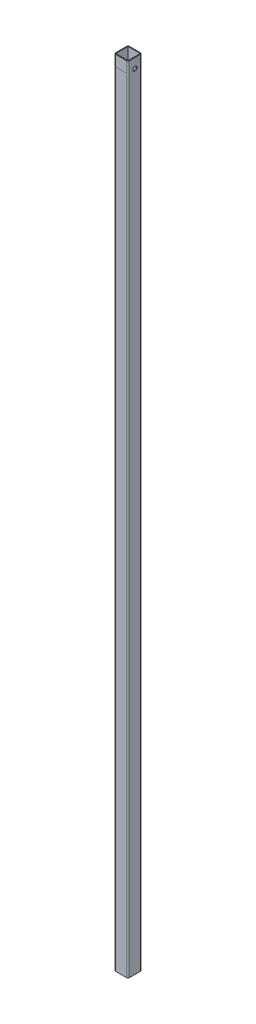
ISO-10303-21;
HEADER;
FILE_DESCRIPTION(('STEP AP214'),'2;1');
FILE_NAME('part.step','',(''),(''),'','','');
FILE_SCHEMA(('AUTOMOTIVE_DESIGN { 1 0 10303 214 1 1 1 1 }'));
ENDSEC;
DATA;
#1=APPLICATION_CONTEXT('core data for automotive mechanical design processes');
#2=APPLICATION_PROTOCOL_DEFINITION('international standard','automotive_design',2000,#1);
#3=PRODUCT_CONTEXT('',#1,'mechanical');
#4=PRODUCT('Part','Part','',(#3));
#5=PRODUCT_RELATED_PRODUCT_CATEGORY('part','',(#4));
#6=PRODUCT_DEFINITION_FORMATION('','',#4);
#7=PRODUCT_DEFINITION_CONTEXT('part definition',#1,'design');
#8=PRODUCT_DEFINITION('design','',#6,#7);
#9=PRODUCT_DEFINITION_SHAPE('','',#8);
#10=(LENGTH_UNIT() NAMED_UNIT(*) SI_UNIT(.MILLI.,.METRE.));
#11=(NAMED_UNIT(*) PLANE_ANGLE_UNIT() SI_UNIT($,.RADIAN.));
#12=(NAMED_UNIT(*) SI_UNIT($,.STERADIAN.) SOLID_ANGLE_UNIT());
#13=UNCERTAINTY_MEASURE_WITH_UNIT(LENGTH_MEASURE(1.E-05),#10,'distance_accuracy_value','');
#14=(GEOMETRIC_REPRESENTATION_CONTEXT(3) GLOBAL_UNCERTAINTY_ASSIGNED_CONTEXT((#13)) GLOBAL_UNIT_ASSIGNED_CONTEXT((#10,
#11,#12)) REPRESENTATION_CONTEXT('',''));
#15=CARTESIAN_POINT('',(0.,0.,0.));
#16=DIRECTION('',(0.,0.,1.));
#17=DIRECTION('',(1.,0.,0.));
#18=AXIS2_PLACEMENT_3D('',#15,#16,#17);
#19=CARTESIAN_POINT('',(-11.4046,1303.02,-11.4046));
#20=DIRECTION('',(0.,0.,1.));
#21=DIRECTION('',(1.,0.,0.));
#22=AXIS2_PLACEMENT_3D('',#19,#20,#21);
#23=PLANE('',#22);
#24=DIRECTION('',(-1.,0.,0.));
#25=VECTOR('',#24,1.);
#26=CARTESIAN_POINT('',(-11.4046,241.3,-11.4046));
#27=LINE('',#26,#25);
#28=CARTESIAN_POINT('',(8.8646,241.3,-11.4046));
#29=VERTEX_POINT('',#28);
#30=CARTESIAN_POINT('',(-8.8646,241.3,-11.4046));
#31=VERTEX_POINT('',#30);
#32=EDGE_CURVE('E11',#29,#31,#27,.T.);
#33=ORIENTED_EDGE('',*,*,#32,.F.);
#34=DIRECTION('',(0.,-1.,0.));
#35=VECTOR('',#34,1.);
#36=CARTESIAN_POINT('',(8.8646,1303.02,-11.4046));
#37=LINE('',#36,#35);
#38=CARTESIAN_POINT('',(8.8646,0.,-11.4046));
#39=VERTEX_POINT('',#38);
#40=EDGE_CURVE('E249',#29,#39,#37,.T.);
#41=ORIENTED_EDGE('',*,*,#40,.T.);
#42=DIRECTION('',(-1.,0.,0.));
#43=VECTOR('',#42,1.);
#44=CARTESIAN_POINT('',(-11.4046,0.,-11.4046));
#45=LINE('',#44,#43);
#46=CARTESIAN_POINT('',(-8.8646,0.,-11.4046));
#47=VERTEX_POINT('',#46);
#48=EDGE_CURVE('E204',#39,#47,#45,.T.);
#49=ORIENTED_EDGE('',*,*,#48,.T.);
#50=DIRECTION('',(0.,-1.,0.));
#51=VECTOR('',#50,1.);
#52=CARTESIAN_POINT('',(-8.8646,1303.02,-11.4046));
#53=LINE('',#52,#51);
#54=EDGE_CURVE('E246',#47,#31,#53,.F.);
#55=ORIENTED_EDGE('',*,*,#54,.T.);
#56=EDGE_LOOP('',(#33,#41,#49,#55));
#57=FACE_BOUND('',#56,.T.);
#58=ADVANCED_FACE('F37',(#57),#23,.F.);
#59=DIRECTION('',(1.,0.,0.));
#60=VECTOR('',#59,1.);
#61=CARTESIAN_POINT('',(-11.4046,259.0292,-11.4046));
#62=LINE('',#61,#60);
#63=CARTESIAN_POINT('',(-8.8646,259.0292,-11.4046));
#64=VERTEX_POINT('',#63);
#65=CARTESIAN_POINT('',(8.8646,259.0292,-11.4046));
#66=VERTEX_POINT('',#65);
#67=EDGE_CURVE('E46',#64,#66,#62,.T.);
#68=ORIENTED_EDGE('',*,*,#67,.F.);
#69=CARTESIAN_POINT('',(-8.8646,1303.02,-11.4046));
#70=VERTEX_POINT('',#69);
#71=EDGE_CURVE('E245',#64,#70,#53,.F.);
#72=ORIENTED_EDGE('',*,*,#71,.T.);
#73=DIRECTION('',(-1.,0.,0.));
#74=VECTOR('',#73,1.);
#75=CARTESIAN_POINT('',(-11.4046,1303.02,-11.4046));
#76=LINE('',#75,#74);
#77=CARTESIAN_POINT('',(8.8646,1303.02,-11.4046));
#78=VERTEX_POINT('',#77);
#79=EDGE_CURVE('E191',#78,#70,#76,.T.);
#80=ORIENTED_EDGE('',*,*,#79,.F.);
#81=EDGE_CURVE('E251',#78,#66,#37,.T.);
#82=ORIENTED_EDGE('',*,*,#81,.T.);
#83=EDGE_LOOP('',(#68,#72,#80,#82));
#84=FACE_BOUND('',#83,.T.);
#85=ADVANCED_FACE('F272',(#84),#23,.F.);
#86=CARTESIAN_POINT('',(-11.4046,1303.02,11.4046));
#87=DIRECTION('',(0.,0.,-1.));
#88=DIRECTION('',(-1.,0.,0.));
#89=AXIS2_PLACEMENT_3D('',#86,#87,#88);
#90=PLANE('',#89);
#91=DIRECTION('',(1.,0.,0.));
#92=VECTOR('',#91,1.);
#93=CARTESIAN_POINT('',(-11.4046,1285.2908,11.4046));
#94=LINE('',#93,#92);
#95=CARTESIAN_POINT('',(-8.8646,1285.2908,11.4046));
#96=VERTEX_POINT('',#95);
#97=CARTESIAN_POINT('',(8.8646,1285.2908,11.4046));
#98=VERTEX_POINT('',#97);
#99=EDGE_CURVE('E253',#96,#98,#94,.T.);
#100=ORIENTED_EDGE('',*,*,#99,.F.);
#101=DIRECTION('',(0.,-1.,0.));
#102=VECTOR('',#101,1.);
#103=CARTESIAN_POINT('',(-8.8646,1303.02,11.4046));
#104=LINE('',#103,#102);
#105=CARTESIAN_POINT('',(-8.8646,0.,11.4046));
#106=VERTEX_POINT('',#105);
#107=EDGE_CURVE('E215',#96,#106,#104,.T.);
#108=ORIENTED_EDGE('',*,*,#107,.T.);
#109=DIRECTION('',(1.,0.,0.));
#110=VECTOR('',#109,1.);
#111=CARTESIAN_POINT('',(-11.4046,0.,11.4046));
#112=LINE('',#111,#110);
#113=CARTESIAN_POINT('',(8.8646,0.,11.4046));
#114=VERTEX_POINT('',#113);
#115=EDGE_CURVE('E192',#106,#114,#112,.T.);
#116=ORIENTED_EDGE('',*,*,#115,.T.);
#117=DIRECTION('',(0.,-1.,0.));
#118=VECTOR('',#117,1.);
#119=CARTESIAN_POINT('',(8.8646,1303.02,11.4046));
#120=LINE('',#119,#118);
#121=EDGE_CURVE('E212',#114,#98,#120,.F.);
#122=ORIENTED_EDGE('',*,*,#121,.T.);
#123=EDGE_LOOP('',(#100,#108,#116,#122));
#124=FACE_BOUND('',#123,.T.);
#125=ADVANCED_FACE('F304',(#124),#90,.F.);
#126=CARTESIAN_POINT('',(0.,1303.02,0.));
#127=DIRECTION('',(0.,-1.,0.));
#128=DIRECTION('',(0.,0.,-1.));
#129=AXIS2_PLACEMENT_3D('',#126,#127,#128);
#130=PLANE('',#129);
#131=DIRECTION('',(0.,0.,1.));
#132=VECTOR('',#131,1.);
#133=CARTESIAN_POINT('',(-11.4046,1303.02,11.4046));
#134=LINE('',#133,#132);
#135=CARTESIAN_POINT('',(-11.4046,1303.02,-8.8646));
#136=VERTEX_POINT('',#135);
#137=CARTESIAN_POINT('',(-11.4046,1303.02,8.8646));
#138=VERTEX_POINT('',#137);
#139=EDGE_CURVE('E195',#136,#138,#134,.T.);
#140=ORIENTED_EDGE('',*,*,#139,.T.);
#141=CARTESIAN_POINT('',(-8.8646,1303.02,8.8646));
#142=DIRECTION('',(0.,-1.,0.));
#143=DIRECTION('',(0.,0.,-1.));
#144=AXIS2_PLACEMENT_3D('',#141,#142,#143);
#145=CIRCLE('',#144,2.54);
#146=CARTESIAN_POINT('',(-8.8646,1303.02,11.4046));
#147=VERTEX_POINT('',#146);
#148=EDGE_CURVE('E238',#138,#147,#145,.F.);
#149=ORIENTED_EDGE('',*,*,#148,.T.);
#150=DIRECTION('',(1.,0.,0.));
#151=VECTOR('',#150,1.);
#152=CARTESIAN_POINT('',(-11.4046,1303.02,11.4046));
#153=LINE('',#152,#151);
#154=CARTESIAN_POINT('',(8.8646,1303.02,11.4046));
#155=VERTEX_POINT('',#154);
#156=EDGE_CURVE('E198',#147,#155,#153,.T.);
#157=ORIENTED_EDGE('',*,*,#156,.T.);
#158=CARTESIAN_POINT('',(8.8646,1303.02,8.8646));
#159=DIRECTION('',(0.,-1.,0.));
#160=DIRECTION('',(0.,0.,-1.));
#161=AXIS2_PLACEMENT_3D('',#158,#159,#160);
#162=CIRCLE('',#161,2.54);
#163=CARTESIAN_POINT('',(11.4046,1303.02,8.8646));
#164=VERTEX_POINT('',#163);
#165=EDGE_CURVE('E236',#155,#164,#162,.F.);
#166=ORIENTED_EDGE('',*,*,#165,.T.);
#167=DIRECTION('',(0.,0.,-1.));
#168=VECTOR('',#167,1.);
#169=CARTESIAN_POINT('',(11.4046,1303.02,11.4046));
#170=LINE('',#169,#168);
#171=CARTESIAN_POINT('',(11.4046,1303.02,-8.8646));
#172=VERTEX_POINT('',#171);
#173=EDGE_CURVE('E188',#164,#172,#170,.T.);
#174=ORIENTED_EDGE('',*,*,#173,.T.);
#175=CARTESIAN_POINT('',(8.8646,1303.02,-8.8646));
#176=DIRECTION('',(0.,-1.,0.));
#177=DIRECTION('',(0.,0.,-1.));
#178=AXIS2_PLACEMENT_3D('',#175,#176,#177);
#179=CIRCLE('',#178,2.54);
#180=EDGE_CURVE('E234',#172,#78,#179,.F.);
#181=ORIENTED_EDGE('',*,*,#180,.T.);
#182=ORIENTED_EDGE('',*,*,#79,.T.);
#183=CARTESIAN_POINT('',(-8.8646,1303.02,-8.8646));
#184=DIRECTION('',(0.,-1.,0.));
#185=DIRECTION('',(0.,0.,-1.));
#186=AXIS2_PLACEMENT_3D('',#183,#184,#185);
#187=CIRCLE('',#186,2.54);
#188=EDGE_CURVE('E232',#70,#136,#187,.F.);
#189=ORIENTED_EDGE('',*,*,#188,.T.);
#190=EDGE_LOOP('',(#140,#149,#157,#166,#174,#181,#182,#189));
#191=FACE_BOUND('',#190,.T.);
#192=DIRECTION('',(0.,0.,-1.));
#193=VECTOR('',#192,1.);
#194=CARTESIAN_POINT('',(10.0711,1303.02,10.0711));
#195=LINE('',#194,#193);
#196=CARTESIAN_POINT('',(10.0711,1303.02,10.0711));
#197=VERTEX_POINT('',#196);
#198=CARTESIAN_POINT('',(10.0711,1303.02,-10.0711));
#199=VERTEX_POINT('',#198);
#200=EDGE_CURVE('E144',#197,#199,#195,.T.);
#201=ORIENTED_EDGE('',*,*,#200,.F.);
#202=DIRECTION('',(1.,0.,0.));
#203=VECTOR('',#202,1.);
#204=CARTESIAN_POINT('',(-10.0711,1303.02,10.0711));
#205=LINE('',#204,#203);
#206=CARTESIAN_POINT('',(-10.0711,1303.02,10.0711));
#207=VERTEX_POINT('',#206);
#208=EDGE_CURVE('E170',#207,#197,#205,.T.);
#209=ORIENTED_EDGE('',*,*,#208,.F.);
#210=DIRECTION('',(0.,0.,1.));
#211=VECTOR('',#210,1.);
#212=CARTESIAN_POINT('',(-10.0711,1303.02,10.0711));
#213=LINE('',#212,#211);
#214=CARTESIAN_POINT('',(-10.0711,1303.02,-10.0711));
#215=VERTEX_POINT('',#214);
#216=EDGE_CURVE('E168',#215,#207,#213,.T.);
#217=ORIENTED_EDGE('',*,*,#216,.F.);
#218=DIRECTION('',(-1.,0.,0.));
#219=VECTOR('',#218,1.);
#220=CARTESIAN_POINT('',(-10.0711,1303.02,-10.0711));
#221=LINE('',#220,#219);
#222=EDGE_CURVE('E154',#199,#215,#221,.T.);
#223=ORIENTED_EDGE('',*,*,#222,.F.);
#224=EDGE_LOOP('',(#201,#209,#217,#223));
#225=FACE_BOUND('',#224,.T.);
#226=ADVANCED_FACE('F166',(#191,#225),#130,.F.);
#227=CARTESIAN_POINT('',(0.,0.,0.));
#228=DIRECTION('',(0.,-1.,0.));
#229=DIRECTION('',(0.,0.,-1.));
#230=AXIS2_PLACEMENT_3D('',#227,#228,#229);
#231=PLANE('',#230);
#232=ORIENTED_EDGE('',*,*,#115,.F.);
#233=CARTESIAN_POINT('',(-8.8646,0.,8.8646));
#234=DIRECTION('',(0.,-1.,0.));
#235=DIRECTION('',(0.,0.,-1.));
#236=AXIS2_PLACEMENT_3D('',#233,#234,#235);
#237=CIRCLE('',#236,2.54);
#238=CARTESIAN_POINT('',(-11.4046,0.,8.8646));
#239=VERTEX_POINT('',#238);
#240=EDGE_CURVE('E225',#106,#239,#237,.T.);
#241=ORIENTED_EDGE('',*,*,#240,.T.);
#242=DIRECTION('',(0.,0.,1.));
#243=VECTOR('',#242,1.);
#244=CARTESIAN_POINT('',(-11.4046,0.,11.4046));
#245=LINE('',#244,#243);
#246=CARTESIAN_POINT('',(-11.4046,0.,-8.8646));
#247=VERTEX_POINT('',#246);
#248=EDGE_CURVE('E207',#247,#239,#245,.T.);
#249=ORIENTED_EDGE('',*,*,#248,.F.);
#250=CARTESIAN_POINT('',(-8.8646,0.,-8.8646));
#251=DIRECTION('',(0.,-1.,0.));
#252=DIRECTION('',(0.,0.,-1.));
#253=AXIS2_PLACEMENT_3D('',#250,#251,#252);
#254=CIRCLE('',#253,2.54);
#255=EDGE_CURVE('E219',#247,#47,#254,.T.);
#256=ORIENTED_EDGE('',*,*,#255,.T.);
#257=ORIENTED_EDGE('',*,*,#48,.F.);
#258=CARTESIAN_POINT('',(8.8646,0.,-8.8646));
#259=DIRECTION('',(0.,-1.,0.));
#260=DIRECTION('',(0.,0.,-1.));
#261=AXIS2_PLACEMENT_3D('',#258,#259,#260);
#262=CIRCLE('',#261,2.54);
#263=CARTESIAN_POINT('',(11.4046,0.,-8.8646));
#264=VERTEX_POINT('',#263);
#265=EDGE_CURVE('E221',#39,#264,#262,.T.);
#266=ORIENTED_EDGE('',*,*,#265,.T.);
#267=DIRECTION('',(0.,0.,-1.));
#268=VECTOR('',#267,1.);
#269=CARTESIAN_POINT('',(11.4046,0.,11.4046));
#270=LINE('',#269,#268);
#271=CARTESIAN_POINT('',(11.4046,0.,8.8646));
#272=VERTEX_POINT('',#271);
#273=EDGE_CURVE('E162',#272,#264,#270,.T.);
#274=ORIENTED_EDGE('',*,*,#273,.F.);
#275=CARTESIAN_POINT('',(8.8646,0.,8.8646));
#276=DIRECTION('',(0.,-1.,0.));
#277=DIRECTION('',(0.,0.,-1.));
#278=AXIS2_PLACEMENT_3D('',#275,#276,#277);
#279=CIRCLE('',#278,2.54);
#280=EDGE_CURVE('E223',#272,#114,#279,.T.);
#281=ORIENTED_EDGE('',*,*,#280,.T.);
#282=EDGE_LOOP('',(#232,#241,#249,#256,#257,#266,#274,#281));
#283=FACE_BOUND('',#282,.T.);
#284=DIRECTION('',(1.,0.,0.));
#285=VECTOR('',#284,1.);
#286=CARTESIAN_POINT('',(-10.0711,0.,10.0711));
#287=LINE('',#286,#285);
#288=CARTESIAN_POINT('',(-10.0711,0.,10.0711));
#289=VERTEX_POINT('',#288);
#290=CARTESIAN_POINT('',(10.0711,0.,10.0711));
#291=VERTEX_POINT('',#290);
#292=EDGE_CURVE('E155',#289,#291,#287,.T.);
#293=ORIENTED_EDGE('',*,*,#292,.T.);
#294=DIRECTION('',(0.,0.,-1.));
#295=VECTOR('',#294,1.);
#296=CARTESIAN_POINT('',(10.0711,0.,10.0711));
#297=LINE('',#296,#295);
#298=CARTESIAN_POINT('',(10.0711,0.,-10.0711));
#299=VERTEX_POINT('',#298);
#300=EDGE_CURVE('E175',#291,#299,#297,.T.);
#301=ORIENTED_EDGE('',*,*,#300,.T.);
#302=DIRECTION('',(-1.,0.,0.));
#303=VECTOR('',#302,1.);
#304=CARTESIAN_POINT('',(-10.0711,0.,-10.0711));
#305=LINE('',#304,#303);
#306=CARTESIAN_POINT('',(-10.0711,0.,-10.0711));
#307=VERTEX_POINT('',#306);
#308=EDGE_CURVE('E161',#299,#307,#305,.T.);
#309=ORIENTED_EDGE('',*,*,#308,.T.);
#310=DIRECTION('',(0.,0.,1.));
#311=VECTOR('',#310,1.);
#312=CARTESIAN_POINT('',(-10.0711,0.,10.0711));
#313=LINE('',#312,#311);
#314=EDGE_CURVE('E179',#307,#289,#313,.T.);
#315=ORIENTED_EDGE('',*,*,#314,.T.);
#316=EDGE_LOOP('',(#293,#301,#309,#315));
#317=FACE_BOUND('',#316,.T.);
#318=ADVANCED_FACE('F285',(#283,#317),#231,.T.);
#319=CARTESIAN_POINT('',(11.4046,1303.02,11.4046));
#320=DIRECTION('',(-1.,0.,0.));
#321=DIRECTION('',(0.,0.,1.));
#322=AXIS2_PLACEMENT_3D('',#319,#320,#321);
#323=PLANE('',#322);
#324=CARTESIAN_POINT('',(11.4046,1287.145,0.));
#325=DIRECTION('',(1.,0.,0.));
#326=DIRECTION('',(0.,0.,-1.));
#327=AXIS2_PLACEMENT_3D('',#324,#325,#326);
#328=CIRCLE('',#327,3.3782);
#329=CARTESIAN_POINT('',(11.4046,1287.145,-3.3782));
#330=VERTEX_POINT('',#329);
#331=EDGE_CURVE('E374',#330,#330,#328,.T.);
#332=ORIENTED_EDGE('',*,*,#331,.F.);
#333=EDGE_LOOP('',(#332));
#334=FACE_BOUND('',#333,.T.);
#335=ORIENTED_EDGE('',*,*,#173,.F.);
#336=DIRECTION('',(0.,-1.,0.));
#337=VECTOR('',#336,1.);
#338=CARTESIAN_POINT('',(11.4046,1303.02,8.8646));
#339=LINE('',#338,#337);
#340=EDGE_CURVE('E242',#164,#272,#339,.T.);
#341=ORIENTED_EDGE('',*,*,#340,.T.);
#342=ORIENTED_EDGE('',*,*,#273,.T.);
#343=DIRECTION('',(0.,-1.,0.));
#344=VECTOR('',#343,1.);
#345=CARTESIAN_POINT('',(11.4046,1303.02,-8.8646));
#346=LINE('',#345,#344);
#347=EDGE_CURVE('E240',#264,#172,#346,.F.);
#348=ORIENTED_EDGE('',*,*,#347,.T.);
#349=EDGE_LOOP('',(#335,#341,#342,#348));
#350=FACE_BOUND('',#349,.T.);
#351=ADVANCED_FACE('F322',(#334,#350),#323,.F.);
#352=EDGE_CURVE('E254',#66,#29,#37,.T.);
#353=ORIENTED_EDGE('',*,*,#352,.T.);
#354=ORIENTED_EDGE('',*,*,#32,.T.);
#355=EDGE_CURVE('E250',#31,#64,#53,.F.);
#356=ORIENTED_EDGE('',*,*,#355,.T.);
#357=ORIENTED_EDGE('',*,*,#67,.T.);
#358=EDGE_LOOP('',(#353,#354,#356,#357));
#359=FACE_BOUND('',#358,.T.);
#360=ADVANCED_FACE('F264',(#359),#23,.F.);
#361=CARTESIAN_POINT('',(-11.4046,1303.02,11.4046));
#362=DIRECTION('',(1.,0.,0.));
#363=DIRECTION('',(0.,0.,-1.));
#364=AXIS2_PLACEMENT_3D('',#361,#362,#363);
#365=PLANE('',#364);
#366=CARTESIAN_POINT('',(-11.4046,1287.145,0.));
#367=DIRECTION('',(1.,0.,0.));
#368=DIRECTION('',(0.,0.,-1.));
#369=AXIS2_PLACEMENT_3D('',#366,#367,#368);
#370=CIRCLE('',#369,3.3782);
#371=CARTESIAN_POINT('',(-11.4046,1287.145,-3.3782));
#372=VERTEX_POINT('',#371);
#373=EDGE_CURVE('E259',#372,#372,#370,.T.);
#374=ORIENTED_EDGE('',*,*,#373,.T.);
#375=EDGE_LOOP('',(#374));
#376=FACE_BOUND('',#375,.T.);
#377=ORIENTED_EDGE('',*,*,#248,.T.);
#378=DIRECTION('',(0.,-1.,0.));
#379=VECTOR('',#378,1.);
#380=CARTESIAN_POINT('',(-11.4046,1303.02,8.8646));
#381=LINE('',#380,#379);
#382=EDGE_CURVE('E230',#239,#138,#381,.F.);
#383=ORIENTED_EDGE('',*,*,#382,.T.);
#384=ORIENTED_EDGE('',*,*,#139,.F.);
#385=DIRECTION('',(0.,-1.,0.));
#386=VECTOR('',#385,1.);
#387=CARTESIAN_POINT('',(-11.4046,1303.02,-8.8646));
#388=LINE('',#387,#386);
#389=EDGE_CURVE('E227',#136,#247,#388,.T.);
#390=ORIENTED_EDGE('',*,*,#389,.T.);
#391=EDGE_LOOP('',(#377,#383,#384,#390));
#392=FACE_BOUND('',#391,.T.);
#393=ADVANCED_FACE('F281',(#376,#392),#365,.F.);
#394=EDGE_CURVE('E216',#147,#96,#104,.T.);
#395=ORIENTED_EDGE('',*,*,#394,.T.);
#396=ORIENTED_EDGE('',*,*,#99,.T.);
#397=EDGE_CURVE('E201',#98,#155,#120,.F.);
#398=ORIENTED_EDGE('',*,*,#397,.T.);
#399=ORIENTED_EDGE('',*,*,#156,.F.);
#400=EDGE_LOOP('',(#395,#396,#398,#399));
#401=FACE_BOUND('',#400,.T.);
#402=ADVANCED_FACE('F297',(#401),#90,.F.);
#403=CARTESIAN_POINT('',(10.0711,1303.02,10.0711));
#404=DIRECTION('',(-1.,0.,0.));
#405=DIRECTION('',(0.,0.,1.));
#406=AXIS2_PLACEMENT_3D('',#403,#404,#405);
#407=PLANE('',#406);
#408=CARTESIAN_POINT('',(10.0711,1287.145,0.));
#409=DIRECTION('',(-1.,0.,0.));
#410=DIRECTION('',(0.,0.,1.));
#411=AXIS2_PLACEMENT_3D('',#408,#409,#410);
#412=CIRCLE('',#411,3.3782);
#413=CARTESIAN_POINT('',(10.0711,1287.145,3.3782));
#414=VERTEX_POINT('',#413);
#415=EDGE_CURVE('E177',#414,#414,#412,.T.);
#416=ORIENTED_EDGE('',*,*,#415,.F.);
#417=EDGE_LOOP('',(#416));
#418=FACE_BOUND('',#417,.T.);
#419=ORIENTED_EDGE('',*,*,#300,.F.);
#420=DIRECTION('',(0.,-1.,0.));
#421=VECTOR('',#420,1.);
#422=CARTESIAN_POINT('',(10.0711,1303.02,10.0711));
#423=LINE('',#422,#421);
#424=EDGE_CURVE('E150',#197,#291,#423,.T.);
#425=ORIENTED_EDGE('',*,*,#424,.F.);
#426=ORIENTED_EDGE('',*,*,#200,.T.);
#427=DIRECTION('',(0.,-1.,0.));
#428=VECTOR('',#427,1.);
#429=CARTESIAN_POINT('',(10.0711,1303.02,-10.0711));
#430=LINE('',#429,#428);
#431=EDGE_CURVE('E147',#199,#299,#430,.T.);
#432=ORIENTED_EDGE('',*,*,#431,.T.);
#433=EDGE_LOOP('',(#419,#425,#426,#432));
#434=FACE_BOUND('',#433,.T.);
#435=ADVANCED_FACE('F146',(#418,#434),#407,.T.);
#436=CARTESIAN_POINT('',(-10.0711,1303.02,-10.0711));
#437=DIRECTION('',(0.,0.,1.));
#438=DIRECTION('',(1.,0.,0.));
#439=AXIS2_PLACEMENT_3D('',#436,#437,#438);
#440=PLANE('',#439);
#441=ORIENTED_EDGE('',*,*,#308,.F.);
#442=ORIENTED_EDGE('',*,*,#431,.F.);
#443=ORIENTED_EDGE('',*,*,#222,.T.);
#444=DIRECTION('',(0.,-1.,0.));
#445=VECTOR('',#444,1.);
#446=CARTESIAN_POINT('',(-10.0711,1303.02,-10.0711));
#447=LINE('',#446,#445);
#448=EDGE_CURVE('E163',#215,#307,#447,.T.);
#449=ORIENTED_EDGE('',*,*,#448,.T.);
#450=EDGE_LOOP('',(#441,#442,#443,#449));
#451=FACE_BOUND('',#450,.T.);
#452=ADVANCED_FACE('F158',(#451),#440,.T.);
#453=CARTESIAN_POINT('',(-10.0711,1303.02,10.0711));
#454=DIRECTION('',(1.,0.,0.));
#455=DIRECTION('',(0.,0.,-1.));
#456=AXIS2_PLACEMENT_3D('',#453,#454,#455);
#457=PLANE('',#456);
#458=CARTESIAN_POINT('',(-10.0711,1287.145,0.));
#459=DIRECTION('',(1.,0.,0.));
#460=DIRECTION('',(0.,0.,-1.));
#461=AXIS2_PLACEMENT_3D('',#458,#459,#460);
#462=CIRCLE('',#461,3.3782);
#463=CARTESIAN_POINT('',(-10.0711,1287.145,-3.3782));
#464=VERTEX_POINT('',#463);
#465=EDGE_CURVE('E257',#464,#464,#462,.T.);
#466=ORIENTED_EDGE('',*,*,#465,.F.);
#467=EDGE_LOOP('',(#466));
#468=FACE_BOUND('',#467,.T.);
#469=ORIENTED_EDGE('',*,*,#314,.F.);
#470=ORIENTED_EDGE('',*,*,#448,.F.);
#471=ORIENTED_EDGE('',*,*,#216,.T.);
#472=DIRECTION('',(0.,-1.,0.));
#473=VECTOR('',#472,1.);
#474=CARTESIAN_POINT('',(-10.0711,1303.02,10.0711));
#475=LINE('',#474,#473);
#476=EDGE_CURVE('E185',#207,#289,#475,.T.);
#477=ORIENTED_EDGE('',*,*,#476,.T.);
#478=EDGE_LOOP('',(#469,#470,#471,#477));
#479=FACE_BOUND('',#478,.T.);
#480=ADVANCED_FACE('F358',(#468,#479),#457,.T.);
#481=CARTESIAN_POINT('',(-10.0711,1303.02,10.0711));
#482=DIRECTION('',(0.,0.,-1.));
#483=DIRECTION('',(-1.,0.,0.));
#484=AXIS2_PLACEMENT_3D('',#481,#482,#483);
#485=PLANE('',#484);
#486=ORIENTED_EDGE('',*,*,#292,.F.);
#487=ORIENTED_EDGE('',*,*,#476,.F.);
#488=ORIENTED_EDGE('',*,*,#208,.T.);
#489=ORIENTED_EDGE('',*,*,#424,.T.);
#490=EDGE_LOOP('',(#486,#487,#488,#489));
#491=FACE_BOUND('',#490,.T.);
#492=ADVANCED_FACE('F337',(#491),#485,.T.);
#493=CARTESIAN_POINT('',(-8.8646,1303.02,8.8646));
#494=DIRECTION('',(0.,-1.,0.));
#495=DIRECTION('',(0.,0.,-1.));
#496=AXIS2_PLACEMENT_3D('',#493,#494,#495);
#497=CYLINDRICAL_SURFACE('',#496,2.54);
#498=ORIENTED_EDGE('',*,*,#148,.F.);
#499=ORIENTED_EDGE('',*,*,#382,.F.);
#500=ORIENTED_EDGE('',*,*,#240,.F.);
#501=ORIENTED_EDGE('',*,*,#107,.F.);
#502=ORIENTED_EDGE('',*,*,#394,.F.);
#503=EDGE_LOOP('',(#498,#499,#500,#501,#502));
#504=FACE_BOUND('',#503,.T.);
#505=ADVANCED_FACE('F292',(#504),#497,.T.);
#506=CARTESIAN_POINT('',(8.8646,1303.02,8.8646));
#507=DIRECTION('',(0.,-1.,0.));
#508=DIRECTION('',(0.,0.,-1.));
#509=AXIS2_PLACEMENT_3D('',#506,#507,#508);
#510=CYLINDRICAL_SURFACE('',#509,2.54);
#511=ORIENTED_EDGE('',*,*,#165,.F.);
#512=ORIENTED_EDGE('',*,*,#397,.F.);
#513=ORIENTED_EDGE('',*,*,#121,.F.);
#514=ORIENTED_EDGE('',*,*,#280,.F.);
#515=ORIENTED_EDGE('',*,*,#340,.F.);
#516=EDGE_LOOP('',(#511,#512,#513,#514,#515));
#517=FACE_BOUND('',#516,.T.);
#518=ADVANCED_FACE('F301',(#517),#510,.T.);
#519=CARTESIAN_POINT('',(8.8646,1303.02,-8.8646));
#520=DIRECTION('',(0.,-1.,0.));
#521=DIRECTION('',(0.,0.,-1.));
#522=AXIS2_PLACEMENT_3D('',#519,#520,#521);
#523=CYLINDRICAL_SURFACE('',#522,2.54);
#524=ORIENTED_EDGE('',*,*,#180,.F.);
#525=ORIENTED_EDGE('',*,*,#347,.F.);
#526=ORIENTED_EDGE('',*,*,#265,.F.);
#527=ORIENTED_EDGE('',*,*,#40,.F.);
#528=ORIENTED_EDGE('',*,*,#352,.F.);
#529=ORIENTED_EDGE('',*,*,#81,.F.);
#530=EDGE_LOOP('',(#524,#525,#526,#527,#528,#529));
#531=FACE_BOUND('',#530,.T.);
#532=ADVANCED_FACE('F269',(#531),#523,.T.);
#533=CARTESIAN_POINT('',(-8.8646,1303.02,-8.8646));
#534=DIRECTION('',(0.,-1.,0.));
#535=DIRECTION('',(0.,0.,-1.));
#536=AXIS2_PLACEMENT_3D('',#533,#534,#535);
#537=CYLINDRICAL_SURFACE('',#536,2.54);
#538=ORIENTED_EDGE('',*,*,#188,.F.);
#539=ORIENTED_EDGE('',*,*,#71,.F.);
#540=ORIENTED_EDGE('',*,*,#355,.F.);
#541=ORIENTED_EDGE('',*,*,#54,.F.);
#542=ORIENTED_EDGE('',*,*,#255,.F.);
#543=ORIENTED_EDGE('',*,*,#389,.F.);
#544=EDGE_LOOP('',(#538,#539,#540,#541,#542,#543));
#545=FACE_BOUND('',#544,.T.);
#546=ADVANCED_FACE('F39',(#545),#537,.T.);
#547=CARTESIAN_POINT('',(11.4046,1287.145,0.));
#548=DIRECTION('',(1.,0.,0.));
#549=DIRECTION('',(0.,0.,-1.));
#550=AXIS2_PLACEMENT_3D('',#547,#548,#549);
#551=CYLINDRICAL_SURFACE('',#550,3.3782);
#552=ORIENTED_EDGE('',*,*,#465,.T.);
#553=EDGE_LOOP('',(#552));
#554=FACE_BOUND('',#553,.T.);
#555=ORIENTED_EDGE('',*,*,#373,.F.);
#556=EDGE_LOOP('',(#555));
#557=FACE_BOUND('',#556,.T.);
#558=ADVANCED_FACE('F343',(#554,#557),#551,.F.);
#559=ORIENTED_EDGE('',*,*,#415,.T.);
#560=EDGE_LOOP('',(#559));
#561=FACE_BOUND('',#560,.T.);
#562=ORIENTED_EDGE('',*,*,#331,.T.);
#563=EDGE_LOOP('',(#562));
#564=FACE_BOUND('',#563,.T.);
#565=ADVANCED_FACE('F347',(#561,#564),#551,.F.);
#566=CLOSED_SHELL('',(#58,#85,#125,#226,#318,#351,#360,#393,#402,#435,#452,#480,#492,#505,#518,
#532,#546,#558,#565));
#567=MANIFOLD_SOLID_BREP('B2',#566);
#568=ADVANCED_BREP_SHAPE_REPRESENTATION('',(#18,#567),#14);
#569=SHAPE_DEFINITION_REPRESENTATION(#9,#568);
ENDSEC;
END-ISO-10303-21;
